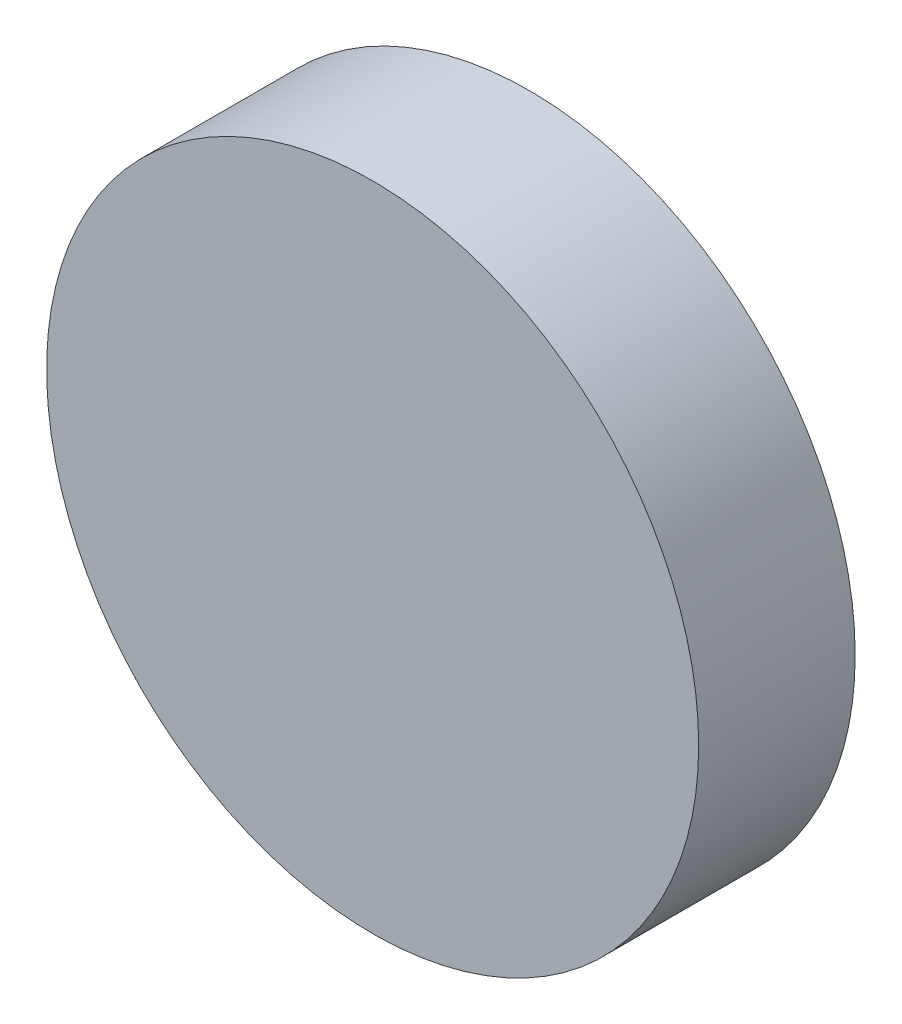
ISO-10303-21;
HEADER;
FILE_DESCRIPTION(('STEP AP214'),'2;1');
FILE_NAME('part.step','',(''),(''),'','','');
FILE_SCHEMA(('AUTOMOTIVE_DESIGN { 1 0 10303 214 1 1 1 1 }'));
ENDSEC;
DATA;
#1=APPLICATION_CONTEXT('core data for automotive mechanical design processes');
#2=APPLICATION_PROTOCOL_DEFINITION('international standard','automotive_design',2000,#1);
#3=PRODUCT_CONTEXT('',#1,'mechanical');
#4=PRODUCT('Part','Part','',(#3));
#5=PRODUCT_RELATED_PRODUCT_CATEGORY('part','',(#4));
#6=PRODUCT_DEFINITION_FORMATION('','',#4);
#7=PRODUCT_DEFINITION_CONTEXT('part definition',#1,'design');
#8=PRODUCT_DEFINITION('design','',#6,#7);
#9=PRODUCT_DEFINITION_SHAPE('','',#8);
#10=(LENGTH_UNIT() NAMED_UNIT(*) SI_UNIT(.MILLI.,.METRE.));
#11=(NAMED_UNIT(*) PLANE_ANGLE_UNIT() SI_UNIT($,.RADIAN.));
#12=(NAMED_UNIT(*) SI_UNIT($,.STERADIAN.) SOLID_ANGLE_UNIT());
#13=UNCERTAINTY_MEASURE_WITH_UNIT(LENGTH_MEASURE(1.E-05),#10,'distance_accuracy_value','');
#14=(GEOMETRIC_REPRESENTATION_CONTEXT(3) GLOBAL_UNCERTAINTY_ASSIGNED_CONTEXT((#13)) GLOBAL_UNIT_ASSIGNED_CONTEXT((#10,
#11,#12)) REPRESENTATION_CONTEXT('',''));
#15=CARTESIAN_POINT('',(0.,0.,0.));
#16=DIRECTION('',(0.,0.,1.));
#17=DIRECTION('',(1.,0.,0.));
#18=AXIS2_PLACEMENT_3D('',#15,#16,#17);
#19=CARTESIAN_POINT('',(0.,0.,18.));
#20=DIRECTION('',(0.,0.,-1.));
#21=DIRECTION('',(-1.,0.,0.));
#22=AXIS2_PLACEMENT_3D('',#19,#20,#21);
#23=CYLINDRICAL_SURFACE('',#22,37.5);
#24=CARTESIAN_POINT('',(0.,0.,18.));
#25=DIRECTION('',(0.,0.,1.));
#26=DIRECTION('',(1.,0.,0.));
#27=AXIS2_PLACEMENT_3D('',#24,#25,#26);
#28=CIRCLE('',#27,37.5);
#29=CARTESIAN_POINT('',(37.5,0.,18.));
#30=VERTEX_POINT('',#29);
#31=EDGE_CURVE('E10',#30,#30,#28,.T.);
#32=ORIENTED_EDGE('',*,*,#31,.F.);
#33=EDGE_LOOP('',(#32));
#34=FACE_BOUND('',#33,.T.);
#35=CARTESIAN_POINT('',(0.,0.,0.));
#36=DIRECTION('',(0.,0.,1.));
#37=DIRECTION('',(1.,0.,0.));
#38=AXIS2_PLACEMENT_3D('',#35,#36,#37);
#39=CIRCLE('',#38,37.5);
#40=CARTESIAN_POINT('',(37.5,0.,0.));
#41=VERTEX_POINT('',#40);
#42=EDGE_CURVE('E26',#41,#41,#39,.T.);
#43=ORIENTED_EDGE('',*,*,#42,.T.);
#44=EDGE_LOOP('',(#43));
#45=FACE_BOUND('',#44,.T.);
#46=ADVANCED_FACE('F20',(#34,#45),#23,.T.);
#47=CARTESIAN_POINT('',(0.,0.,18.));
#48=DIRECTION('',(0.,0.,1.));
#49=DIRECTION('',(1.,0.,0.));
#50=AXIS2_PLACEMENT_3D('',#47,#48,#49);
#51=PLANE('',#50);
#52=ORIENTED_EDGE('',*,*,#31,.T.);
#53=EDGE_LOOP('',(#52));
#54=FACE_BOUND('',#53,.T.);
#55=ADVANCED_FACE('F35',(#54),#51,.T.);
#56=CARTESIAN_POINT('',(0.,0.,0.));
#57=DIRECTION('',(0.,0.,1.));
#58=DIRECTION('',(1.,0.,0.));
#59=AXIS2_PLACEMENT_3D('',#56,#57,#58);
#60=PLANE('',#59);
#61=ORIENTED_EDGE('',*,*,#42,.F.);
#62=EDGE_LOOP('',(#61));
#63=FACE_BOUND('',#62,.T.);
#64=ADVANCED_FACE('F33',(#63),#60,.F.);
#65=CLOSED_SHELL('',(#46,#55,#64));
#66=MANIFOLD_SOLID_BREP('B2',#65);
#67=ADVANCED_BREP_SHAPE_REPRESENTATION('',(#18,#66),#14);
#68=SHAPE_DEFINITION_REPRESENTATION(#9,#67);
ENDSEC;
END-ISO-10303-21;
